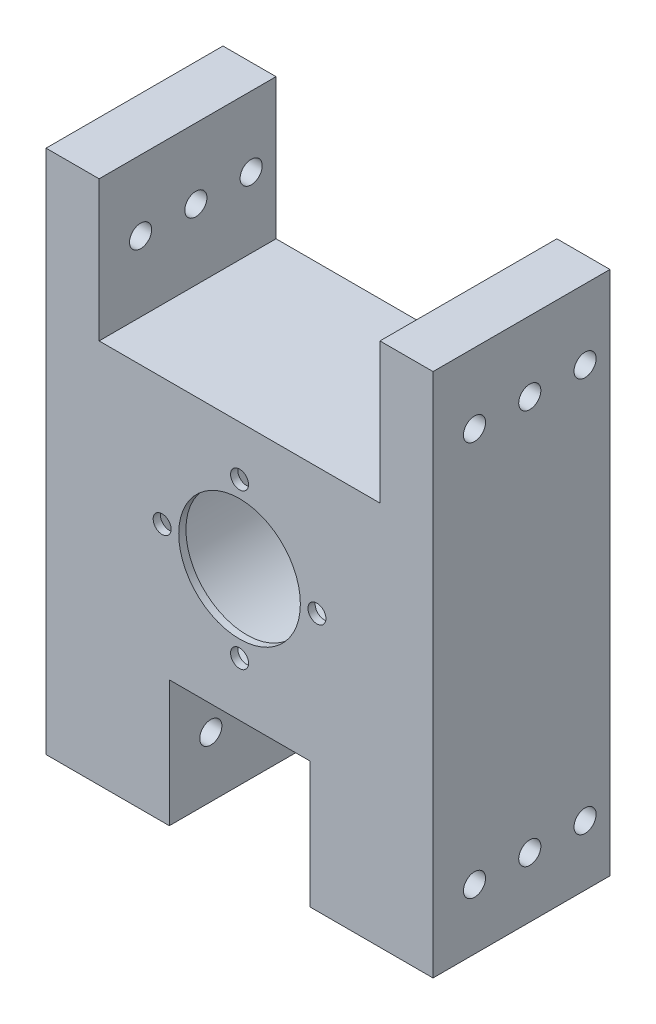
ISO-10303-21;
HEADER;
FILE_DESCRIPTION(('STEP AP214'),'2;1');
FILE_NAME('part.step','',(''),(''),'','','');
FILE_SCHEMA(('AUTOMOTIVE_DESIGN { 1 0 10303 214 1 1 1 1 }'));
ENDSEC;
DATA;
#1=APPLICATION_CONTEXT('core data for automotive mechanical design processes');
#2=APPLICATION_PROTOCOL_DEFINITION('international standard','automotive_design',2000,#1);
#3=PRODUCT_CONTEXT('',#1,'mechanical');
#4=PRODUCT('Part','Part','',(#3));
#5=PRODUCT_RELATED_PRODUCT_CATEGORY('part','',(#4));
#6=PRODUCT_DEFINITION_FORMATION('','',#4);
#7=PRODUCT_DEFINITION_CONTEXT('part definition',#1,'design');
#8=PRODUCT_DEFINITION('design','',#6,#7);
#9=PRODUCT_DEFINITION_SHAPE('','',#8);
#10=(LENGTH_UNIT() NAMED_UNIT(*) SI_UNIT(.MILLI.,.METRE.));
#11=(NAMED_UNIT(*) PLANE_ANGLE_UNIT() SI_UNIT($,.RADIAN.));
#12=(NAMED_UNIT(*) SI_UNIT($,.STERADIAN.) SOLID_ANGLE_UNIT());
#13=UNCERTAINTY_MEASURE_WITH_UNIT(LENGTH_MEASURE(1.E-05),#10,'distance_accuracy_value','');
#14=(GEOMETRIC_REPRESENTATION_CONTEXT(3) GLOBAL_UNCERTAINTY_ASSIGNED_CONTEXT((#13)) GLOBAL_UNIT_ASSIGNED_CONTEXT((#10,
#11,#12)) REPRESENTATION_CONTEXT('',''));
#15=CARTESIAN_POINT('',(0.,0.,0.));
#16=DIRECTION('',(0.,0.,1.));
#17=DIRECTION('',(1.,0.,0.));
#18=AXIS2_PLACEMENT_3D('',#15,#16,#17);
#19=CARTESIAN_POINT('',(35.,-20.,55.));
#20=DIRECTION('',(-1.,0.,0.));
#21=DIRECTION('',(0.,-1.,0.));
#22=AXIS2_PLACEMENT_3D('',#19,#20,#21);
#23=PLANE('',#22);
#24=CARTESIAN_POINT('',(35.,-35.7,37.5));
#25=DIRECTION('',(1.,0.,0.));
#26=DIRECTION('',(0.,0.,-1.));
#27=AXIS2_PLACEMENT_3D('',#24,#25,#26);
#28=CIRCLE('',#27,2.);
#29=CARTESIAN_POINT('',(35.,-35.7,35.5));
#30=VERTEX_POINT('',#29);
#31=EDGE_CURVE('E302',#30,#30,#28,.F.);
#32=ORIENTED_EDGE('',*,*,#31,.T.);
#33=EDGE_LOOP('',(#32));
#34=FACE_BOUND('',#33,.T.);
#35=CARTESIAN_POINT('',(35.,-35.7,47.5));
#36=DIRECTION('',(1.,0.,0.));
#37=DIRECTION('',(0.,0.,-1.));
#38=AXIS2_PLACEMENT_3D('',#35,#36,#37);
#39=CIRCLE('',#38,2.);
#40=CARTESIAN_POINT('',(35.,-35.7,45.5));
#41=VERTEX_POINT('',#40);
#42=EDGE_CURVE('E312',#41,#41,#39,.F.);
#43=ORIENTED_EDGE('',*,*,#42,.T.);
#44=EDGE_LOOP('',(#43));
#45=FACE_BOUND('',#44,.T.);
#46=CARTESIAN_POINT('',(35.,35.7,47.5));
#47=DIRECTION('',(1.,0.,0.));
#48=DIRECTION('',(0.,0.,-1.));
#49=AXIS2_PLACEMENT_3D('',#46,#47,#48);
#50=CIRCLE('',#49,2.);
#51=CARTESIAN_POINT('',(35.,35.7,45.5));
#52=VERTEX_POINT('',#51);
#53=EDGE_CURVE('E301',#52,#52,#50,.T.);
#54=ORIENTED_EDGE('',*,*,#53,.F.);
#55=EDGE_LOOP('',(#54));
#56=FACE_BOUND('',#55,.T.);
#57=CARTESIAN_POINT('',(35.,35.7,27.5));
#58=DIRECTION('',(1.,0.,0.));
#59=DIRECTION('',(0.,0.,-1.));
#60=AXIS2_PLACEMENT_3D('',#57,#58,#59);
#61=CIRCLE('',#60,2.00000000000001);
#62=CARTESIAN_POINT('',(35.,35.7,25.5));
#63=VERTEX_POINT('',#62);
#64=EDGE_CURVE('E328',#63,#63,#61,.T.);
#65=ORIENTED_EDGE('',*,*,#64,.F.);
#66=EDGE_LOOP('',(#65));
#67=FACE_BOUND('',#66,.T.);
#68=DIRECTION('',(0.,0.,-1.));
#69=VECTOR('',#68,1.);
#70=CARTESIAN_POINT('',(35.,-46.6,55.));
#71=LINE('',#70,#69);
#72=CARTESIAN_POINT('',(35.,-46.6,55.));
#73=VERTEX_POINT('',#72);
#74=CARTESIAN_POINT('',(35.,-46.6,23.));
#75=VERTEX_POINT('',#74);
#76=EDGE_CURVE('E152',#73,#75,#71,.T.);
#77=ORIENTED_EDGE('',*,*,#76,.T.);
#78=DIRECTION('',(0.,-1.,0.));
#79=VECTOR('',#78,1.);
#80=CARTESIAN_POINT('',(35.,-1.1,23.));
#81=LINE('',#80,#79);
#82=CARTESIAN_POINT('',(35.,48.4,23.));
#83=VERTEX_POINT('',#82);
#84=EDGE_CURVE('E134',#83,#75,#81,.T.);
#85=ORIENTED_EDGE('',*,*,#84,.F.);
#86=DIRECTION('',(0.,0.,-1.));
#87=VECTOR('',#86,1.);
#88=CARTESIAN_POINT('',(35.,48.4,55.));
#89=LINE('',#88,#87);
#90=CARTESIAN_POINT('',(35.,48.4,55.));
#91=VERTEX_POINT('',#90);
#92=EDGE_CURVE('E149',#91,#83,#89,.T.);
#93=ORIENTED_EDGE('',*,*,#92,.F.);
#94=DIRECTION('',(0.,1.,0.));
#95=VECTOR('',#94,1.);
#96=CARTESIAN_POINT('',(35.,-20.,55.));
#97=LINE('',#96,#95);
#98=EDGE_CURVE('E234',#73,#91,#97,.T.);
#99=ORIENTED_EDGE('',*,*,#98,.F.);
#100=EDGE_LOOP('',(#77,#85,#93,#99));
#101=FACE_BOUND('',#100,.T.);
#102=CARTESIAN_POINT('',(35.,-35.7,27.5));
#103=DIRECTION('',(1.,0.,0.));
#104=DIRECTION('',(0.,0.,-1.));
#105=AXIS2_PLACEMENT_3D('',#102,#103,#104);
#106=CIRCLE('',#105,2.);
#107=CARTESIAN_POINT('',(35.,-35.7,25.5));
#108=VERTEX_POINT('',#107);
#109=EDGE_CURVE('E311',#108,#108,#106,.F.);
#110=ORIENTED_EDGE('',*,*,#109,.T.);
#111=EDGE_LOOP('',(#110));
#112=FACE_BOUND('',#111,.T.);
#113=CARTESIAN_POINT('',(35.,35.7,37.5));
#114=DIRECTION('',(1.,0.,0.));
#115=DIRECTION('',(0.,0.,-1.));
#116=AXIS2_PLACEMENT_3D('',#113,#114,#115);
#117=CIRCLE('',#116,2.);
#118=CARTESIAN_POINT('',(35.,35.7,35.5));
#119=VERTEX_POINT('',#118);
#120=EDGE_CURVE('E327',#119,#119,#117,.T.);
#121=ORIENTED_EDGE('',*,*,#120,.F.);
#122=EDGE_LOOP('',(#121));
#123=FACE_BOUND('',#122,.T.);
#124=ADVANCED_FACE('F39',(#34,#45,#56,#67,#101,#112,#123),#23,.F.);
#125=CARTESIAN_POINT('',(-35.,-24.5,55.));
#126=DIRECTION('',(1.,0.,0.));
#127=DIRECTION('',(0.,0.,-1.));
#128=AXIS2_PLACEMENT_3D('',#125,#126,#127);
#129=PLANE('',#128);
#130=CARTESIAN_POINT('',(-35.,-35.7,37.5));
#131=DIRECTION('',(1.,0.,0.));
#132=DIRECTION('',(0.,0.,-1.));
#133=AXIS2_PLACEMENT_3D('',#130,#131,#132);
#134=CIRCLE('',#133,2.);
#135=CARTESIAN_POINT('',(-35.,-35.7,35.5));
#136=VERTEX_POINT('',#135);
#137=EDGE_CURVE('E306',#136,#136,#134,.F.);
#138=ORIENTED_EDGE('',*,*,#137,.F.);
#139=EDGE_LOOP('',(#138));
#140=FACE_BOUND('',#139,.T.);
#141=CARTESIAN_POINT('',(-35.,-35.7,47.5));
#142=DIRECTION('',(1.,0.,0.));
#143=DIRECTION('',(0.,0.,-1.));
#144=AXIS2_PLACEMENT_3D('',#141,#142,#143);
#145=CIRCLE('',#144,2.);
#146=CARTESIAN_POINT('',(-35.,-35.7,45.5));
#147=VERTEX_POINT('',#146);
#148=EDGE_CURVE('E307',#147,#147,#145,.F.);
#149=ORIENTED_EDGE('',*,*,#148,.F.);
#150=EDGE_LOOP('',(#149));
#151=FACE_BOUND('',#150,.T.);
#152=CARTESIAN_POINT('',(-35.,35.7,47.5));
#153=DIRECTION('',(1.,0.,0.));
#154=DIRECTION('',(0.,0.,-1.));
#155=AXIS2_PLACEMENT_3D('',#152,#153,#154);
#156=CIRCLE('',#155,2.);
#157=CARTESIAN_POINT('',(-35.,35.7,45.5));
#158=VERTEX_POINT('',#157);
#159=EDGE_CURVE('E323',#158,#158,#156,.T.);
#160=ORIENTED_EDGE('',*,*,#159,.T.);
#161=EDGE_LOOP('',(#160));
#162=FACE_BOUND('',#161,.T.);
#163=CARTESIAN_POINT('',(-35.,35.7,27.5));
#164=DIRECTION('',(1.,0.,0.));
#165=DIRECTION('',(0.,0.,-1.));
#166=AXIS2_PLACEMENT_3D('',#163,#164,#165);
#167=CIRCLE('',#166,2.00000000000001);
#168=CARTESIAN_POINT('',(-35.,35.7,25.5));
#169=VERTEX_POINT('',#168);
#170=EDGE_CURVE('E316',#169,#169,#167,.T.);
#171=ORIENTED_EDGE('',*,*,#170,.T.);
#172=EDGE_LOOP('',(#171));
#173=FACE_BOUND('',#172,.T.);
#174=DIRECTION('',(0.,0.,-1.));
#175=VECTOR('',#174,1.);
#176=CARTESIAN_POINT('',(-35.,48.4,55.));
#177=LINE('',#176,#175);
#178=CARTESIAN_POINT('',(-35.,48.4,55.));
#179=VERTEX_POINT('',#178);
#180=CARTESIAN_POINT('',(-35.,48.4,23.));
#181=VERTEX_POINT('',#180);
#182=EDGE_CURVE('E251',#179,#181,#177,.T.);
#183=ORIENTED_EDGE('',*,*,#182,.T.);
#184=DIRECTION('',(0.,-1.,0.));
#185=VECTOR('',#184,1.);
#186=CARTESIAN_POINT('',(-35.,-24.5,23.));
#187=LINE('',#186,#185);
#188=CARTESIAN_POINT('',(-35.,-46.6,23.));
#189=VERTEX_POINT('',#188);
#190=EDGE_CURVE('E57',#181,#189,#187,.T.);
#191=ORIENTED_EDGE('',*,*,#190,.T.);
#192=DIRECTION('',(0.,0.,-1.));
#193=VECTOR('',#192,1.);
#194=CARTESIAN_POINT('',(-35.,-46.6,55.));
#195=LINE('',#194,#193);
#196=CARTESIAN_POINT('',(-35.,-46.6,55.));
#197=VERTEX_POINT('',#196);
#198=EDGE_CURVE('E11',#197,#189,#195,.T.);
#199=ORIENTED_EDGE('',*,*,#198,.F.);
#200=DIRECTION('',(0.,-1.,0.));
#201=VECTOR('',#200,1.);
#202=CARTESIAN_POINT('',(-35.,-24.5,55.));
#203=LINE('',#202,#201);
#204=EDGE_CURVE('E65',#179,#197,#203,.T.);
#205=ORIENTED_EDGE('',*,*,#204,.F.);
#206=EDGE_LOOP('',(#183,#191,#199,#205));
#207=FACE_BOUND('',#206,.T.);
#208=CARTESIAN_POINT('',(-35.,-35.7,27.5));
#209=DIRECTION('',(1.,0.,0.));
#210=DIRECTION('',(0.,0.,-1.));
#211=AXIS2_PLACEMENT_3D('',#208,#209,#210);
#212=CIRCLE('',#211,2.);
#213=CARTESIAN_POINT('',(-35.,-35.7,25.5));
#214=VERTEX_POINT('',#213);
#215=EDGE_CURVE('E345',#214,#214,#212,.F.);
#216=ORIENTED_EDGE('',*,*,#215,.F.);
#217=EDGE_LOOP('',(#216));
#218=FACE_BOUND('',#217,.T.);
#219=CARTESIAN_POINT('',(-35.,35.7,37.5));
#220=DIRECTION('',(1.,0.,0.));
#221=DIRECTION('',(0.,0.,-1.));
#222=AXIS2_PLACEMENT_3D('',#219,#220,#221);
#223=CIRCLE('',#222,2.);
#224=CARTESIAN_POINT('',(-35.,35.7,35.5));
#225=VERTEX_POINT('',#224);
#226=EDGE_CURVE('E332',#225,#225,#223,.T.);
#227=ORIENTED_EDGE('',*,*,#226,.T.);
#228=EDGE_LOOP('',(#227));
#229=FACE_BOUND('',#228,.T.);
#230=ADVANCED_FACE('F425',(#140,#151,#162,#173,#207,#218,#229),#129,.F.);
#231=CARTESIAN_POINT('',(0.,0.,55.));
#232=DIRECTION('',(0.,0.,-1.));
#233=DIRECTION('',(-1.,0.,0.));
#234=AXIS2_PLACEMENT_3D('',#231,#232,#233);
#235=CYLINDRICAL_SURFACE('',#234,11.);
#236=CARTESIAN_POINT('',(0.,0.,55.));
#237=DIRECTION('',(0.,0.,1.));
#238=DIRECTION('',(1.,0.,0.));
#239=AXIS2_PLACEMENT_3D('',#236,#237,#238);
#240=CIRCLE('',#239,11.);
#241=CARTESIAN_POINT('',(11.,0.,55.));
#242=VERTEX_POINT('',#241);
#243=EDGE_CURVE('E186',#242,#242,#240,.T.);
#244=ORIENTED_EDGE('',*,*,#243,.T.);
#245=EDGE_LOOP('',(#244));
#246=FACE_BOUND('',#245,.T.);
#247=CARTESIAN_POINT('',(0.,0.,53.7));
#248=DIRECTION('',(0.,0.,-1.));
#249=DIRECTION('',(-1.,0.,0.));
#250=AXIS2_PLACEMENT_3D('',#247,#248,#249);
#251=CIRCLE('',#250,11.);
#252=CARTESIAN_POINT('',(-11.,0.,53.7));
#253=VERTEX_POINT('',#252);
#254=EDGE_CURVE('E182',#253,#253,#251,.T.);
#255=ORIENTED_EDGE('',*,*,#254,.T.);
#256=EDGE_LOOP('',(#255));
#257=FACE_BOUND('',#256,.T.);
#258=ADVANCED_FACE('F417',(#246,#257),#235,.F.);
#259=CARTESIAN_POINT('',(0.,0.,55.));
#260=DIRECTION('',(0.,0.,1.));
#261=DIRECTION('',(1.,0.,0.));
#262=AXIS2_PLACEMENT_3D('',#259,#260,#261);
#263=PLANE('',#262);
#264=CARTESIAN_POINT('',(0.,14.,55.));
#265=DIRECTION('',(0.,0.,1.));
#266=DIRECTION('',(1.,0.,0.));
#267=AXIS2_PLACEMENT_3D('',#264,#265,#266);
#268=CIRCLE('',#267,1.625);
#269=CARTESIAN_POINT('',(1.625,14.,55.));
#270=VERTEX_POINT('',#269);
#271=EDGE_CURVE('E193',#270,#270,#268,.T.);
#272=ORIENTED_EDGE('',*,*,#271,.F.);
#273=EDGE_LOOP('',(#272));
#274=FACE_BOUND('',#273,.T.);
#275=CARTESIAN_POINT('',(14.,0.,55.));
#276=DIRECTION('',(0.,0.,1.));
#277=DIRECTION('',(1.,0.,0.));
#278=AXIS2_PLACEMENT_3D('',#275,#276,#277);
#279=CIRCLE('',#278,1.625);
#280=CARTESIAN_POINT('',(15.625,0.,55.));
#281=VERTEX_POINT('',#280);
#282=EDGE_CURVE('E400',#281,#281,#279,.T.);
#283=ORIENTED_EDGE('',*,*,#282,.F.);
#284=EDGE_LOOP('',(#283));
#285=FACE_BOUND('',#284,.T.);
#286=CARTESIAN_POINT('',(0.,-14.,55.));
#287=DIRECTION('',(0.,0.,1.));
#288=DIRECTION('',(1.,0.,0.));
#289=AXIS2_PLACEMENT_3D('',#286,#287,#288);
#290=CIRCLE('',#289,1.625);
#291=CARTESIAN_POINT('',(1.625,-14.,55.));
#292=VERTEX_POINT('',#291);
#293=EDGE_CURVE('E403',#292,#292,#290,.T.);
#294=ORIENTED_EDGE('',*,*,#293,.F.);
#295=EDGE_LOOP('',(#294));
#296=FACE_BOUND('',#295,.T.);
#297=CARTESIAN_POINT('',(-14.,0.,55.));
#298=DIRECTION('',(0.,0.,1.));
#299=DIRECTION('',(1.,0.,0.));
#300=AXIS2_PLACEMENT_3D('',#297,#298,#299);
#301=CIRCLE('',#300,1.625);
#302=CARTESIAN_POINT('',(-12.375,0.,55.));
#303=VERTEX_POINT('',#302);
#304=EDGE_CURVE('E212',#303,#303,#301,.T.);
#305=ORIENTED_EDGE('',*,*,#304,.F.);
#306=EDGE_LOOP('',(#305));
#307=FACE_BOUND('',#306,.T.);
#308=ORIENTED_EDGE('',*,*,#204,.T.);
#309=DIRECTION('',(1.,0.,0.));
#310=VECTOR('',#309,1.);
#311=CARTESIAN_POINT('',(-35.,-46.6,55.));
#312=LINE('',#311,#310);
#313=CARTESIAN_POINT('',(-12.7,-46.6,55.));
#314=VERTEX_POINT('',#313);
#315=EDGE_CURVE('E219',#197,#314,#312,.T.);
#316=ORIENTED_EDGE('',*,*,#315,.T.);
#317=DIRECTION('',(0.,1.,0.));
#318=VECTOR('',#317,1.);
#319=CARTESIAN_POINT('',(-12.7,-23.74,55.));
#320=LINE('',#319,#318);
#321=CARTESIAN_POINT('',(-12.7,-23.74,55.));
#322=VERTEX_POINT('',#321);
#323=EDGE_CURVE('E222',#314,#322,#320,.T.);
#324=ORIENTED_EDGE('',*,*,#323,.T.);
#325=DIRECTION('',(1.,0.,0.));
#326=VECTOR('',#325,1.);
#327=CARTESIAN_POINT('',(-12.7,-23.74,55.));
#328=LINE('',#327,#326);
#329=CARTESIAN_POINT('',(12.7,-23.74,55.));
#330=VERTEX_POINT('',#329);
#331=EDGE_CURVE('E225',#322,#330,#328,.T.);
#332=ORIENTED_EDGE('',*,*,#331,.T.);
#333=DIRECTION('',(0.,-1.,0.));
#334=VECTOR('',#333,1.);
#335=CARTESIAN_POINT('',(12.7,-23.74,55.));
#336=LINE('',#335,#334);
#337=CARTESIAN_POINT('',(12.7,-46.6,55.));
#338=VERTEX_POINT('',#337);
#339=EDGE_CURVE('E228',#330,#338,#336,.T.);
#340=ORIENTED_EDGE('',*,*,#339,.T.);
#341=DIRECTION('',(1.,0.,0.));
#342=VECTOR('',#341,1.);
#343=CARTESIAN_POINT('',(35.,-46.6,55.));
#344=LINE('',#343,#342);
#345=EDGE_CURVE('E231',#338,#73,#344,.T.);
#346=ORIENTED_EDGE('',*,*,#345,.T.);
#347=ORIENTED_EDGE('',*,*,#98,.T.);
#348=DIRECTION('',(-1.,0.,0.));
#349=VECTOR('',#348,1.);
#350=CARTESIAN_POINT('',(25.4,48.4,55.));
#351=LINE('',#350,#349);
#352=CARTESIAN_POINT('',(25.4,48.4,55.));
#353=VERTEX_POINT('',#352);
#354=EDGE_CURVE('E156',#91,#353,#351,.T.);
#355=ORIENTED_EDGE('',*,*,#354,.T.);
#356=DIRECTION('',(0.,-1.,0.));
#357=VECTOR('',#356,1.);
#358=CARTESIAN_POINT('',(25.4,23.,55.));
#359=LINE('',#358,#357);
#360=CARTESIAN_POINT('',(25.4,23.,55.));
#361=VERTEX_POINT('',#360);
#362=EDGE_CURVE('E239',#353,#361,#359,.T.);
#363=ORIENTED_EDGE('',*,*,#362,.T.);
#364=DIRECTION('',(-1.,0.,0.));
#365=VECTOR('',#364,1.);
#366=CARTESIAN_POINT('',(-25.4,23.,55.));
#367=LINE('',#366,#365);
#368=CARTESIAN_POINT('',(-25.4,23.,55.));
#369=VERTEX_POINT('',#368);
#370=EDGE_CURVE('E242',#361,#369,#367,.T.);
#371=ORIENTED_EDGE('',*,*,#370,.T.);
#372=DIRECTION('',(0.,1.,0.));
#373=VECTOR('',#372,1.);
#374=CARTESIAN_POINT('',(-25.4,48.4,55.));
#375=LINE('',#374,#373);
#376=CARTESIAN_POINT('',(-25.4,48.4,55.));
#377=VERTEX_POINT('',#376);
#378=EDGE_CURVE('E245',#369,#377,#375,.T.);
#379=ORIENTED_EDGE('',*,*,#378,.T.);
#380=DIRECTION('',(-1.,0.,0.));
#381=VECTOR('',#380,1.);
#382=CARTESIAN_POINT('',(-25.4,48.4,55.));
#383=LINE('',#382,#381);
#384=EDGE_CURVE('E248',#377,#179,#383,.T.);
#385=ORIENTED_EDGE('',*,*,#384,.T.);
#386=EDGE_LOOP('',(#308,#316,#324,#332,#340,#346,#347,#355,#363,#371,#379,#385));
#387=FACE_BOUND('',#386,.T.);
#388=ORIENTED_EDGE('',*,*,#243,.F.);
#389=EDGE_LOOP('',(#388));
#390=FACE_BOUND('',#389,.T.);
#391=ADVANCED_FACE('F414',(#274,#285,#296,#307,#387,#390),#263,.T.);
#392=CARTESIAN_POINT('',(-35.,-46.6,55.));
#393=DIRECTION('',(0.,1.,0.));
#394=DIRECTION('',(-1.,0.,0.));
#395=AXIS2_PLACEMENT_3D('',#392,#393,#394);
#396=PLANE('',#395);
#397=ORIENTED_EDGE('',*,*,#198,.T.);
#398=DIRECTION('',(1.,0.,0.));
#399=VECTOR('',#398,1.);
#400=CARTESIAN_POINT('',(-35.,-46.6,23.));
#401=LINE('',#400,#399);
#402=CARTESIAN_POINT('',(-12.7,-46.6,23.));
#403=VERTEX_POINT('',#402);
#404=EDGE_CURVE('E282',#189,#403,#401,.T.);
#405=ORIENTED_EDGE('',*,*,#404,.T.);
#406=DIRECTION('',(0.,0.,-1.));
#407=VECTOR('',#406,1.);
#408=CARTESIAN_POINT('',(-12.7,-46.6,55.));
#409=LINE('',#408,#407);
#410=EDGE_CURVE('E49',#314,#403,#409,.T.);
#411=ORIENTED_EDGE('',*,*,#410,.F.);
#412=ORIENTED_EDGE('',*,*,#315,.F.);
#413=EDGE_LOOP('',(#397,#405,#411,#412));
#414=FACE_BOUND('',#413,.T.);
#415=ADVANCED_FACE('F41',(#414),#396,.F.);
#416=CARTESIAN_POINT('',(-12.7,-23.74,55.));
#417=DIRECTION('',(-1.,0.,0.));
#418=DIRECTION('',(0.,-1.,0.));
#419=AXIS2_PLACEMENT_3D('',#416,#417,#418);
#420=PLANE('',#419);
#421=CARTESIAN_POINT('',(-12.7,-35.7,37.5));
#422=DIRECTION('',(-1.,0.,0.));
#423=DIRECTION('',(0.,-1.,0.));
#424=AXIS2_PLACEMENT_3D('',#421,#422,#423);
#425=CIRCLE('',#424,2.);
#426=CARTESIAN_POINT('',(-12.7,-37.7,37.5));
#427=VERTEX_POINT('',#426);
#428=EDGE_CURVE('E393',#427,#427,#425,.F.);
#429=ORIENTED_EDGE('',*,*,#428,.F.);
#430=EDGE_LOOP('',(#429));
#431=FACE_BOUND('',#430,.T.);
#432=CARTESIAN_POINT('',(-12.7,-35.7,47.5));
#433=DIRECTION('',(-1.,0.,0.));
#434=DIRECTION('',(0.,-1.,0.));
#435=AXIS2_PLACEMENT_3D('',#432,#433,#434);
#436=CIRCLE('',#435,2.);
#437=CARTESIAN_POINT('',(-12.7,-37.7,47.5));
#438=VERTEX_POINT('',#437);
#439=EDGE_CURVE('E385',#438,#438,#436,.F.);
#440=ORIENTED_EDGE('',*,*,#439,.F.);
#441=EDGE_LOOP('',(#440));
#442=FACE_BOUND('',#441,.T.);
#443=CARTESIAN_POINT('',(-12.7,-35.7,27.5));
#444=DIRECTION('',(-1.,0.,0.));
#445=DIRECTION('',(0.,-1.,0.));
#446=AXIS2_PLACEMENT_3D('',#443,#444,#445);
#447=CIRCLE('',#446,2.);
#448=CARTESIAN_POINT('',(-12.7,-37.7,27.5));
#449=VERTEX_POINT('',#448);
#450=EDGE_CURVE('E353',#449,#449,#447,.F.);
#451=ORIENTED_EDGE('',*,*,#450,.F.);
#452=EDGE_LOOP('',(#451));
#453=FACE_BOUND('',#452,.T.);
#454=ORIENTED_EDGE('',*,*,#410,.T.);
#455=DIRECTION('',(0.,1.,0.));
#456=VECTOR('',#455,1.);
#457=CARTESIAN_POINT('',(-12.7,-23.74,23.));
#458=LINE('',#457,#456);
#459=CARTESIAN_POINT('',(-12.7,-23.74,23.));
#460=VERTEX_POINT('',#459);
#461=EDGE_CURVE('E286',#403,#460,#458,.T.);
#462=ORIENTED_EDGE('',*,*,#461,.T.);
#463=DIRECTION('',(0.,0.,-1.));
#464=VECTOR('',#463,1.);
#465=CARTESIAN_POINT('',(-12.7,-23.74,55.));
#466=LINE('',#465,#464);
#467=EDGE_CURVE('E175',#322,#460,#466,.T.);
#468=ORIENTED_EDGE('',*,*,#467,.F.);
#469=ORIENTED_EDGE('',*,*,#323,.F.);
#470=EDGE_LOOP('',(#454,#462,#468,#469));
#471=FACE_BOUND('',#470,.T.);
#472=ADVANCED_FACE('F467',(#431,#442,#453,#471),#420,.F.);
#473=CARTESIAN_POINT('',(-12.7,-23.74,55.));
#474=DIRECTION('',(0.,1.,0.));
#475=DIRECTION('',(0.,0.,1.));
#476=AXIS2_PLACEMENT_3D('',#473,#474,#475);
#477=PLANE('',#476);
#478=ORIENTED_EDGE('',*,*,#467,.T.);
#479=DIRECTION('',(1.,0.,0.));
#480=VECTOR('',#479,1.);
#481=CARTESIAN_POINT('',(-12.7,-23.74,23.));
#482=LINE('',#481,#480);
#483=CARTESIAN_POINT('',(12.7,-23.74,23.));
#484=VERTEX_POINT('',#483);
#485=EDGE_CURVE('E290',#460,#484,#482,.T.);
#486=ORIENTED_EDGE('',*,*,#485,.T.);
#487=DIRECTION('',(0.,0.,-1.));
#488=VECTOR('',#487,1.);
#489=CARTESIAN_POINT('',(12.7,-23.74,55.));
#490=LINE('',#489,#488);
#491=EDGE_CURVE('E171',#330,#484,#490,.T.);
#492=ORIENTED_EDGE('',*,*,#491,.F.);
#493=ORIENTED_EDGE('',*,*,#331,.F.);
#494=EDGE_LOOP('',(#478,#486,#492,#493));
#495=FACE_BOUND('',#494,.T.);
#496=ADVANCED_FACE('F464',(#495),#477,.F.);
#497=CARTESIAN_POINT('',(12.7,-23.74,55.));
#498=DIRECTION('',(1.,0.,0.));
#499=DIRECTION('',(0.,1.,0.));
#500=AXIS2_PLACEMENT_3D('',#497,#498,#499);
#501=PLANE('',#500);
#502=CARTESIAN_POINT('',(12.7,-35.7,37.5));
#503=DIRECTION('',(1.,0.,0.));
#504=DIRECTION('',(0.,1.,0.));
#505=AXIS2_PLACEMENT_3D('',#502,#503,#504);
#506=CIRCLE('',#505,2.);
#507=CARTESIAN_POINT('',(12.7,-33.7,37.5));
#508=VERTEX_POINT('',#507);
#509=EDGE_CURVE('E389',#508,#508,#506,.F.);
#510=ORIENTED_EDGE('',*,*,#509,.F.);
#511=EDGE_LOOP('',(#510));
#512=FACE_BOUND('',#511,.T.);
#513=CARTESIAN_POINT('',(12.7,-35.7,47.5));
#514=DIRECTION('',(1.,0.,0.));
#515=DIRECTION('',(0.,1.,0.));
#516=AXIS2_PLACEMENT_3D('',#513,#514,#515);
#517=CIRCLE('',#516,2.);
#518=CARTESIAN_POINT('',(12.7,-33.7,47.5));
#519=VERTEX_POINT('',#518);
#520=EDGE_CURVE('E381',#519,#519,#517,.F.);
#521=ORIENTED_EDGE('',*,*,#520,.F.);
#522=EDGE_LOOP('',(#521));
#523=FACE_BOUND('',#522,.T.);
#524=CARTESIAN_POINT('',(12.7,-35.7,27.5));
#525=DIRECTION('',(1.,0.,0.));
#526=DIRECTION('',(0.,1.,0.));
#527=AXIS2_PLACEMENT_3D('',#524,#525,#526);
#528=CIRCLE('',#527,2.);
#529=CARTESIAN_POINT('',(12.7,-33.7,27.5));
#530=VERTEX_POINT('',#529);
#531=EDGE_CURVE('E349',#530,#530,#528,.F.);
#532=ORIENTED_EDGE('',*,*,#531,.F.);
#533=EDGE_LOOP('',(#532));
#534=FACE_BOUND('',#533,.T.);
#535=ORIENTED_EDGE('',*,*,#491,.T.);
#536=DIRECTION('',(0.,-1.,0.));
#537=VECTOR('',#536,1.);
#538=CARTESIAN_POINT('',(12.7,-23.74,23.));
#539=LINE('',#538,#537);
#540=CARTESIAN_POINT('',(12.7,-46.6,23.));
#541=VERTEX_POINT('',#540);
#542=EDGE_CURVE('E294',#484,#541,#539,.T.);
#543=ORIENTED_EDGE('',*,*,#542,.T.);
#544=DIRECTION('',(0.,0.,-1.));
#545=VECTOR('',#544,1.);
#546=CARTESIAN_POINT('',(12.7,-46.6,55.));
#547=LINE('',#546,#545);
#548=EDGE_CURVE('E162',#338,#541,#547,.T.);
#549=ORIENTED_EDGE('',*,*,#548,.F.);
#550=ORIENTED_EDGE('',*,*,#339,.F.);
#551=EDGE_LOOP('',(#535,#543,#549,#550));
#552=FACE_BOUND('',#551,.T.);
#553=ADVANCED_FACE('F460',(#512,#523,#534,#552),#501,.F.);
#554=CARTESIAN_POINT('',(35.,-46.6,55.));
#555=DIRECTION('',(0.,1.,0.));
#556=DIRECTION('',(-1.,0.,0.));
#557=AXIS2_PLACEMENT_3D('',#554,#555,#556);
#558=PLANE('',#557);
#559=ORIENTED_EDGE('',*,*,#548,.T.);
#560=DIRECTION('',(1.,0.,0.));
#561=VECTOR('',#560,1.);
#562=CARTESIAN_POINT('',(35.,-46.6,23.));
#563=LINE('',#562,#561);
#564=EDGE_CURVE('E298',#541,#75,#563,.T.);
#565=ORIENTED_EDGE('',*,*,#564,.T.);
#566=ORIENTED_EDGE('',*,*,#76,.F.);
#567=ORIENTED_EDGE('',*,*,#345,.F.);
#568=EDGE_LOOP('',(#559,#565,#566,#567));
#569=FACE_BOUND('',#568,.T.);
#570=ADVANCED_FACE('F457',(#569),#558,.F.);
#571=CARTESIAN_POINT('',(25.4,48.4,55.));
#572=DIRECTION('',(0.,-1.,0.));
#573=DIRECTION('',(1.,0.,0.));
#574=AXIS2_PLACEMENT_3D('',#571,#572,#573);
#575=PLANE('',#574);
#576=ORIENTED_EDGE('',*,*,#92,.T.);
#577=DIRECTION('',(-1.,0.,0.));
#578=VECTOR('',#577,1.);
#579=CARTESIAN_POINT('',(25.4,48.4,23.));
#580=LINE('',#579,#578);
#581=CARTESIAN_POINT('',(25.4,48.4,23.));
#582=VERTEX_POINT('',#581);
#583=EDGE_CURVE('E131',#83,#582,#580,.T.);
#584=ORIENTED_EDGE('',*,*,#583,.T.);
#585=DIRECTION('',(0.,0.,-1.));
#586=VECTOR('',#585,1.);
#587=CARTESIAN_POINT('',(25.4,48.4,55.));
#588=LINE('',#587,#586);
#589=EDGE_CURVE('E158',#353,#582,#588,.T.);
#590=ORIENTED_EDGE('',*,*,#589,.F.);
#591=ORIENTED_EDGE('',*,*,#354,.F.);
#592=EDGE_LOOP('',(#576,#584,#590,#591));
#593=FACE_BOUND('',#592,.T.);
#594=ADVANCED_FACE('F155',(#593),#575,.F.);
#595=CARTESIAN_POINT('',(25.4,23.,55.));
#596=DIRECTION('',(1.,0.,0.));
#597=DIRECTION('',(0.,1.,0.));
#598=AXIS2_PLACEMENT_3D('',#595,#596,#597);
#599=PLANE('',#598);
#600=CARTESIAN_POINT('',(25.4,35.7,47.5));
#601=DIRECTION('',(1.,0.,0.));
#602=DIRECTION('',(0.,1.,0.));
#603=AXIS2_PLACEMENT_3D('',#600,#601,#602);
#604=CIRCLE('',#603,2.);
#605=CARTESIAN_POINT('',(25.4,37.7,47.5));
#606=VERTEX_POINT('',#605);
#607=EDGE_CURVE('E377',#606,#606,#604,.T.);
#608=ORIENTED_EDGE('',*,*,#607,.T.);
#609=EDGE_LOOP('',(#608));
#610=FACE_BOUND('',#609,.T.);
#611=CARTESIAN_POINT('',(25.4,35.7,37.5));
#612=DIRECTION('',(1.,0.,0.));
#613=DIRECTION('',(0.,1.,0.));
#614=AXIS2_PLACEMENT_3D('',#611,#612,#613);
#615=CIRCLE('',#614,2.);
#616=CARTESIAN_POINT('',(25.4,37.7,37.5));
#617=VERTEX_POINT('',#616);
#618=EDGE_CURVE('E369',#617,#617,#615,.T.);
#619=ORIENTED_EDGE('',*,*,#618,.T.);
#620=EDGE_LOOP('',(#619));
#621=FACE_BOUND('',#620,.T.);
#622=CARTESIAN_POINT('',(25.4,35.7,27.5));
#623=DIRECTION('',(1.,0.,0.));
#624=DIRECTION('',(0.,1.,0.));
#625=AXIS2_PLACEMENT_3D('',#622,#623,#624);
#626=CIRCLE('',#625,2.00000000000001);
#627=CARTESIAN_POINT('',(25.4,37.7,27.5));
#628=VERTEX_POINT('',#627);
#629=EDGE_CURVE('E361',#628,#628,#626,.T.);
#630=ORIENTED_EDGE('',*,*,#629,.T.);
#631=EDGE_LOOP('',(#630));
#632=FACE_BOUND('',#631,.T.);
#633=ORIENTED_EDGE('',*,*,#589,.T.);
#634=DIRECTION('',(0.,-1.,0.));
#635=VECTOR('',#634,1.);
#636=CARTESIAN_POINT('',(25.4,23.,23.));
#637=LINE('',#636,#635);
#638=CARTESIAN_POINT('',(25.4,23.,23.));
#639=VERTEX_POINT('',#638);
#640=EDGE_CURVE('E137',#582,#639,#637,.T.);
#641=ORIENTED_EDGE('',*,*,#640,.T.);
#642=DIRECTION('',(0.,0.,-1.));
#643=VECTOR('',#642,1.);
#644=CARTESIAN_POINT('',(25.4,23.,55.));
#645=LINE('',#644,#643);
#646=EDGE_CURVE('E164',#361,#639,#645,.T.);
#647=ORIENTED_EDGE('',*,*,#646,.F.);
#648=ORIENTED_EDGE('',*,*,#362,.F.);
#649=EDGE_LOOP('',(#633,#641,#647,#648));
#650=FACE_BOUND('',#649,.T.);
#651=ADVANCED_FACE('F272',(#610,#621,#632,#650),#599,.F.);
#652=CARTESIAN_POINT('',(-25.4,23.,55.));
#653=DIRECTION('',(0.,-1.,0.));
#654=DIRECTION('',(1.,0.,0.));
#655=AXIS2_PLACEMENT_3D('',#652,#653,#654);
#656=PLANE('',#655);
#657=ORIENTED_EDGE('',*,*,#646,.T.);
#658=DIRECTION('',(-1.,0.,0.));
#659=VECTOR('',#658,1.);
#660=CARTESIAN_POINT('',(-25.4,23.,23.));
#661=LINE('',#660,#659);
#662=CARTESIAN_POINT('',(-25.4,23.,23.));
#663=VERTEX_POINT('',#662);
#664=EDGE_CURVE('E269',#639,#663,#661,.T.);
#665=ORIENTED_EDGE('',*,*,#664,.T.);
#666=DIRECTION('',(0.,0.,-1.));
#667=VECTOR('',#666,1.);
#668=CARTESIAN_POINT('',(-25.4,23.,55.));
#669=LINE('',#668,#667);
#670=EDGE_CURVE('E258',#369,#663,#669,.T.);
#671=ORIENTED_EDGE('',*,*,#670,.F.);
#672=ORIENTED_EDGE('',*,*,#370,.F.);
#673=EDGE_LOOP('',(#657,#665,#671,#672));
#674=FACE_BOUND('',#673,.T.);
#675=ADVANCED_FACE('F267',(#674),#656,.F.);
#676=CARTESIAN_POINT('',(-25.4,48.4,55.));
#677=DIRECTION('',(-1.,0.,0.));
#678=DIRECTION('',(0.,-1.,0.));
#679=AXIS2_PLACEMENT_3D('',#676,#677,#678);
#680=PLANE('',#679);
#681=CARTESIAN_POINT('',(-25.4,35.7,47.5));
#682=DIRECTION('',(-1.,0.,0.));
#683=DIRECTION('',(0.,-1.,0.));
#684=AXIS2_PLACEMENT_3D('',#681,#682,#683);
#685=CIRCLE('',#684,2.);
#686=CARTESIAN_POINT('',(-25.4,33.7,47.5));
#687=VERTEX_POINT('',#686);
#688=EDGE_CURVE('E373',#687,#687,#685,.T.);
#689=ORIENTED_EDGE('',*,*,#688,.T.);
#690=EDGE_LOOP('',(#689));
#691=FACE_BOUND('',#690,.T.);
#692=CARTESIAN_POINT('',(-25.4,35.7,37.5));
#693=DIRECTION('',(-1.,0.,0.));
#694=DIRECTION('',(0.,-1.,0.));
#695=AXIS2_PLACEMENT_3D('',#692,#693,#694);
#696=CIRCLE('',#695,2.);
#697=CARTESIAN_POINT('',(-25.4,33.7,37.5));
#698=VERTEX_POINT('',#697);
#699=EDGE_CURVE('E365',#698,#698,#696,.T.);
#700=ORIENTED_EDGE('',*,*,#699,.T.);
#701=EDGE_LOOP('',(#700));
#702=FACE_BOUND('',#701,.T.);
#703=CARTESIAN_POINT('',(-25.4,35.7,27.5));
#704=DIRECTION('',(-1.,0.,0.));
#705=DIRECTION('',(0.,-1.,0.));
#706=AXIS2_PLACEMENT_3D('',#703,#704,#705);
#707=CIRCLE('',#706,2.00000000000001);
#708=CARTESIAN_POINT('',(-25.4,33.7,27.5));
#709=VERTEX_POINT('',#708);
#710=EDGE_CURVE('E357',#709,#709,#707,.T.);
#711=ORIENTED_EDGE('',*,*,#710,.T.);
#712=EDGE_LOOP('',(#711));
#713=FACE_BOUND('',#712,.T.);
#714=ORIENTED_EDGE('',*,*,#670,.T.);
#715=DIRECTION('',(0.,1.,0.));
#716=VECTOR('',#715,1.);
#717=CARTESIAN_POINT('',(-25.4,48.4,23.));
#718=LINE('',#717,#716);
#719=CARTESIAN_POINT('',(-25.4,48.4,23.));
#720=VERTEX_POINT('',#719);
#721=EDGE_CURVE('E276',#663,#720,#718,.T.);
#722=ORIENTED_EDGE('',*,*,#721,.T.);
#723=DIRECTION('',(0.,0.,-1.));
#724=VECTOR('',#723,1.);
#725=CARTESIAN_POINT('',(-25.4,48.4,55.));
#726=LINE('',#725,#724);
#727=EDGE_CURVE('E254',#377,#720,#726,.T.);
#728=ORIENTED_EDGE('',*,*,#727,.F.);
#729=ORIENTED_EDGE('',*,*,#378,.F.);
#730=EDGE_LOOP('',(#714,#722,#728,#729));
#731=FACE_BOUND('',#730,.T.);
#732=ADVANCED_FACE('F687',(#691,#702,#713,#731),#680,.F.);
#733=CARTESIAN_POINT('',(-25.4,48.4,55.));
#734=DIRECTION('',(0.,-1.,0.));
#735=DIRECTION('',(0.,0.,-1.));
#736=AXIS2_PLACEMENT_3D('',#733,#734,#735);
#737=PLANE('',#736);
#738=ORIENTED_EDGE('',*,*,#727,.T.);
#739=DIRECTION('',(-1.,0.,0.));
#740=VECTOR('',#739,1.);
#741=CARTESIAN_POINT('',(-25.4,48.4,23.));
#742=LINE('',#741,#740);
#743=EDGE_CURVE('E488',#720,#181,#742,.T.);
#744=ORIENTED_EDGE('',*,*,#743,.T.);
#745=ORIENTED_EDGE('',*,*,#182,.F.);
#746=ORIENTED_EDGE('',*,*,#384,.F.);
#747=EDGE_LOOP('',(#738,#744,#745,#746));
#748=FACE_BOUND('',#747,.T.);
#749=ADVANCED_FACE('F441',(#748),#737,.F.);
#750=CARTESIAN_POINT('',(0.,0.,53.7));
#751=DIRECTION('',(0.,0.,-1.));
#752=DIRECTION('',(-1.,0.,0.));
#753=AXIS2_PLACEMENT_3D('',#750,#751,#752);
#754=CYLINDRICAL_SURFACE('',#753,18.);
#755=CARTESIAN_POINT('',(0.,0.,23.));
#756=DIRECTION('',(0.,0.,1.));
#757=DIRECTION('',(1.,0.,0.));
#758=AXIS2_PLACEMENT_3D('',#755,#756,#757);
#759=CIRCLE('',#758,18.);
#760=CARTESIAN_POINT('',(18.,0.,23.));
#761=VERTEX_POINT('',#760);
#762=EDGE_CURVE('E43',#761,#761,#759,.F.);
#763=ORIENTED_EDGE('',*,*,#762,.T.);
#764=EDGE_LOOP('',(#763));
#765=FACE_BOUND('',#764,.T.);
#766=CARTESIAN_POINT('',(0.,0.,53.7));
#767=DIRECTION('',(0.,0.,-1.));
#768=DIRECTION('',(-1.,0.,0.));
#769=AXIS2_PLACEMENT_3D('',#766,#767,#768);
#770=CIRCLE('',#769,18.);
#771=CARTESIAN_POINT('',(-18.,0.,53.7));
#772=VERTEX_POINT('',#771);
#773=EDGE_CURVE('E187',#772,#772,#770,.T.);
#774=ORIENTED_EDGE('',*,*,#773,.F.);
#775=EDGE_LOOP('',(#774));
#776=FACE_BOUND('',#775,.T.);
#777=ADVANCED_FACE('F431',(#765,#776),#754,.F.);
#778=CARTESIAN_POINT('',(0.,0.,53.7));
#779=DIRECTION('',(0.,0.,-1.));
#780=DIRECTION('',(-1.,0.,0.));
#781=AXIS2_PLACEMENT_3D('',#778,#779,#780);
#782=PLANE('',#781);
#783=CARTESIAN_POINT('',(0.,14.,53.7));
#784=DIRECTION('',(0.,0.,-1.));
#785=DIRECTION('',(-1.,0.,0.));
#786=AXIS2_PLACEMENT_3D('',#783,#784,#785);
#787=CIRCLE('',#786,1.625);
#788=CARTESIAN_POINT('',(-1.625,14.,53.7));
#789=VERTEX_POINT('',#788);
#790=EDGE_CURVE('E200',#789,#789,#787,.T.);
#791=ORIENTED_EDGE('',*,*,#790,.F.);
#792=EDGE_LOOP('',(#791));
#793=FACE_BOUND('',#792,.T.);
#794=CARTESIAN_POINT('',(14.,0.,53.7));
#795=DIRECTION('',(0.,0.,-1.));
#796=DIRECTION('',(-1.,0.,0.));
#797=AXIS2_PLACEMENT_3D('',#794,#795,#796);
#798=CIRCLE('',#797,1.625);
#799=CARTESIAN_POINT('',(12.375,0.,53.7));
#800=VERTEX_POINT('',#799);
#801=EDGE_CURVE('E197',#800,#800,#798,.T.);
#802=ORIENTED_EDGE('',*,*,#801,.F.);
#803=EDGE_LOOP('',(#802));
#804=FACE_BOUND('',#803,.T.);
#805=CARTESIAN_POINT('',(0.,-14.,53.7));
#806=DIRECTION('',(0.,0.,-1.));
#807=DIRECTION('',(-1.,0.,0.));
#808=AXIS2_PLACEMENT_3D('',#805,#806,#807);
#809=CIRCLE('',#808,1.625);
#810=CARTESIAN_POINT('',(-1.625,-14.,53.7));
#811=VERTEX_POINT('',#810);
#812=EDGE_CURVE('E192',#811,#811,#809,.T.);
#813=ORIENTED_EDGE('',*,*,#812,.F.);
#814=EDGE_LOOP('',(#813));
#815=FACE_BOUND('',#814,.T.);
#816=CARTESIAN_POINT('',(-14.,0.,53.7));
#817=DIRECTION('',(0.,0.,-1.));
#818=DIRECTION('',(-1.,0.,0.));
#819=AXIS2_PLACEMENT_3D('',#816,#817,#818);
#820=CIRCLE('',#819,1.625);
#821=CARTESIAN_POINT('',(-15.625,0.,53.7));
#822=VERTEX_POINT('',#821);
#823=EDGE_CURVE('E188',#822,#822,#820,.T.);
#824=ORIENTED_EDGE('',*,*,#823,.F.);
#825=EDGE_LOOP('',(#824));
#826=FACE_BOUND('',#825,.T.);
#827=ORIENTED_EDGE('',*,*,#254,.F.);
#828=EDGE_LOOP('',(#827));
#829=FACE_BOUND('',#828,.T.);
#830=ORIENTED_EDGE('',*,*,#773,.T.);
#831=EDGE_LOOP('',(#830));
#832=FACE_BOUND('',#831,.T.);
#833=ADVANCED_FACE('F429',(#793,#804,#815,#826,#829,#832),#782,.T.);
#834=CARTESIAN_POINT('',(-14.,0.,0.));
#835=DIRECTION('',(0.,0.,1.));
#836=DIRECTION('',(1.,0.,0.));
#837=AXIS2_PLACEMENT_3D('',#834,#835,#836);
#838=CYLINDRICAL_SURFACE('',#837,1.625);
#839=ORIENTED_EDGE('',*,*,#823,.T.);
#840=EDGE_LOOP('',(#839));
#841=FACE_BOUND('',#840,.T.);
#842=ORIENTED_EDGE('',*,*,#304,.T.);
#843=EDGE_LOOP('',(#842));
#844=FACE_BOUND('',#843,.T.);
#845=ADVANCED_FACE('F412',(#841,#844),#838,.F.);
#846=CARTESIAN_POINT('',(0.,-14.,0.));
#847=DIRECTION('',(0.,0.,1.));
#848=DIRECTION('',(1.,0.,0.));
#849=AXIS2_PLACEMENT_3D('',#846,#847,#848);
#850=CYLINDRICAL_SURFACE('',#849,1.625);
#851=ORIENTED_EDGE('',*,*,#812,.T.);
#852=EDGE_LOOP('',(#851));
#853=FACE_BOUND('',#852,.T.);
#854=ORIENTED_EDGE('',*,*,#293,.T.);
#855=EDGE_LOOP('',(#854));
#856=FACE_BOUND('',#855,.T.);
#857=ADVANCED_FACE('F438',(#853,#856),#850,.F.);
#858=CARTESIAN_POINT('',(14.,0.,0.));
#859=DIRECTION('',(0.,0.,1.));
#860=DIRECTION('',(1.,0.,0.));
#861=AXIS2_PLACEMENT_3D('',#858,#859,#860);
#862=CYLINDRICAL_SURFACE('',#861,1.625);
#863=ORIENTED_EDGE('',*,*,#801,.T.);
#864=EDGE_LOOP('',(#863));
#865=FACE_BOUND('',#864,.T.);
#866=ORIENTED_EDGE('',*,*,#282,.T.);
#867=EDGE_LOOP('',(#866));
#868=FACE_BOUND('',#867,.T.);
#869=ADVANCED_FACE('F539',(#865,#868),#862,.F.);
#870=CARTESIAN_POINT('',(0.,14.,0.));
#871=DIRECTION('',(0.,0.,1.));
#872=DIRECTION('',(1.,0.,0.));
#873=AXIS2_PLACEMENT_3D('',#870,#871,#872);
#874=CYLINDRICAL_SURFACE('',#873,1.625);
#875=ORIENTED_EDGE('',*,*,#790,.T.);
#876=EDGE_LOOP('',(#875));
#877=FACE_BOUND('',#876,.T.);
#878=ORIENTED_EDGE('',*,*,#271,.T.);
#879=EDGE_LOOP('',(#878));
#880=FACE_BOUND('',#879,.T.);
#881=ADVANCED_FACE('F535',(#877,#880),#874,.F.);
#882=CARTESIAN_POINT('',(-35.,-35.7,27.5));
#883=DIRECTION('',(1.,0.,0.));
#884=DIRECTION('',(0.,0.,-1.));
#885=AXIS2_PLACEMENT_3D('',#882,#883,#884);
#886=CYLINDRICAL_SURFACE('',#885,2.);
#887=ORIENTED_EDGE('',*,*,#215,.T.);
#888=EDGE_LOOP('',(#887));
#889=FACE_BOUND('',#888,.T.);
#890=ORIENTED_EDGE('',*,*,#450,.T.);
#891=EDGE_LOOP('',(#890));
#892=FACE_BOUND('',#891,.T.);
#893=ADVANCED_FACE('F532',(#889,#892),#886,.F.);
#894=CARTESIAN_POINT('',(-35.,35.7,27.5));
#895=DIRECTION('',(1.,0.,0.));
#896=DIRECTION('',(0.,0.,-1.));
#897=AXIS2_PLACEMENT_3D('',#894,#895,#896);
#898=CYLINDRICAL_SURFACE('',#897,2.00000000000001);
#899=ORIENTED_EDGE('',*,*,#170,.F.);
#900=EDGE_LOOP('',(#899));
#901=FACE_BOUND('',#900,.T.);
#902=ORIENTED_EDGE('',*,*,#710,.F.);
#903=EDGE_LOOP('',(#902));
#904=FACE_BOUND('',#903,.T.);
#905=ADVANCED_FACE('F527',(#901,#904),#898,.F.);
#906=CARTESIAN_POINT('',(-35.,35.7,37.5));
#907=DIRECTION('',(1.,0.,0.));
#908=DIRECTION('',(0.,0.,-1.));
#909=AXIS2_PLACEMENT_3D('',#906,#907,#908);
#910=CYLINDRICAL_SURFACE('',#909,2.);
#911=ORIENTED_EDGE('',*,*,#226,.F.);
#912=EDGE_LOOP('',(#911));
#913=FACE_BOUND('',#912,.T.);
#914=ORIENTED_EDGE('',*,*,#699,.F.);
#915=EDGE_LOOP('',(#914));
#916=FACE_BOUND('',#915,.T.);
#917=ADVANCED_FACE('F531',(#913,#916),#910,.F.);
#918=CARTESIAN_POINT('',(-35.,35.7,47.5));
#919=DIRECTION('',(1.,0.,0.));
#920=DIRECTION('',(0.,0.,-1.));
#921=AXIS2_PLACEMENT_3D('',#918,#919,#920);
#922=CYLINDRICAL_SURFACE('',#921,2.);
#923=ORIENTED_EDGE('',*,*,#159,.F.);
#924=EDGE_LOOP('',(#923));
#925=FACE_BOUND('',#924,.T.);
#926=ORIENTED_EDGE('',*,*,#688,.F.);
#927=EDGE_LOOP('',(#926));
#928=FACE_BOUND('',#927,.T.);
#929=ADVANCED_FACE('F516',(#925,#928),#922,.F.);
#930=CARTESIAN_POINT('',(-35.,-35.7,47.5));
#931=DIRECTION('',(1.,0.,0.));
#932=DIRECTION('',(0.,0.,-1.));
#933=AXIS2_PLACEMENT_3D('',#930,#931,#932);
#934=CYLINDRICAL_SURFACE('',#933,2.);
#935=ORIENTED_EDGE('',*,*,#148,.T.);
#936=EDGE_LOOP('',(#935));
#937=FACE_BOUND('',#936,.T.);
#938=ORIENTED_EDGE('',*,*,#439,.T.);
#939=EDGE_LOOP('',(#938));
#940=FACE_BOUND('',#939,.T.);
#941=ADVANCED_FACE('F512',(#937,#940),#934,.F.);
#942=CARTESIAN_POINT('',(-35.,-35.7,37.5));
#943=DIRECTION('',(1.,0.,0.));
#944=DIRECTION('',(0.,0.,-1.));
#945=AXIS2_PLACEMENT_3D('',#942,#943,#944);
#946=CYLINDRICAL_SURFACE('',#945,2.);
#947=ORIENTED_EDGE('',*,*,#137,.T.);
#948=EDGE_LOOP('',(#947));
#949=FACE_BOUND('',#948,.T.);
#950=ORIENTED_EDGE('',*,*,#428,.T.);
#951=EDGE_LOOP('',(#950));
#952=FACE_BOUND('',#951,.T.);
#953=ADVANCED_FACE('F508',(#949,#952),#946,.F.);
#954=ORIENTED_EDGE('',*,*,#64,.T.);
#955=EDGE_LOOP('',(#954));
#956=FACE_BOUND('',#955,.T.);
#957=ORIENTED_EDGE('',*,*,#629,.F.);
#958=EDGE_LOOP('',(#957));
#959=FACE_BOUND('',#958,.T.);
#960=ADVANCED_FACE('F511',(#956,#959),#898,.F.);
#961=ORIENTED_EDGE('',*,*,#120,.T.);
#962=EDGE_LOOP('',(#961));
#963=FACE_BOUND('',#962,.T.);
#964=ORIENTED_EDGE('',*,*,#618,.F.);
#965=EDGE_LOOP('',(#964));
#966=FACE_BOUND('',#965,.T.);
#967=ADVANCED_FACE('F522',(#963,#966),#910,.F.);
#968=ORIENTED_EDGE('',*,*,#53,.T.);
#969=EDGE_LOOP('',(#968));
#970=FACE_BOUND('',#969,.T.);
#971=ORIENTED_EDGE('',*,*,#607,.F.);
#972=EDGE_LOOP('',(#971));
#973=FACE_BOUND('',#972,.T.);
#974=ADVANCED_FACE('F518',(#970,#973),#922,.F.);
#975=ORIENTED_EDGE('',*,*,#109,.F.);
#976=EDGE_LOOP('',(#975));
#977=FACE_BOUND('',#976,.T.);
#978=ORIENTED_EDGE('',*,*,#531,.T.);
#979=EDGE_LOOP('',(#978));
#980=FACE_BOUND('',#979,.T.);
#981=ADVANCED_FACE('F521',(#977,#980),#886,.F.);
#982=ORIENTED_EDGE('',*,*,#42,.F.);
#983=EDGE_LOOP('',(#982));
#984=FACE_BOUND('',#983,.T.);
#985=ORIENTED_EDGE('',*,*,#520,.T.);
#986=EDGE_LOOP('',(#985));
#987=FACE_BOUND('',#986,.T.);
#988=ADVANCED_FACE('F505',(#984,#987),#934,.F.);
#989=ORIENTED_EDGE('',*,*,#31,.F.);
#990=EDGE_LOOP('',(#989));
#991=FACE_BOUND('',#990,.T.);
#992=ORIENTED_EDGE('',*,*,#509,.T.);
#993=EDGE_LOOP('',(#992));
#994=FACE_BOUND('',#993,.T.);
#995=ADVANCED_FACE('F500',(#991,#994),#946,.F.);
#996=CARTESIAN_POINT('',(-39.,-1.09999999999999,23.));
#997=DIRECTION('',(0.,0.,1.));
#998=DIRECTION('',(1.,0.,0.));
#999=AXIS2_PLACEMENT_3D('',#996,#997,#998);
#1000=PLANE('',#999);
#1001=ORIENTED_EDGE('',*,*,#762,.F.);
#1002=EDGE_LOOP('',(#1001));
#1003=FACE_BOUND('',#1002,.T.);
#1004=ORIENTED_EDGE('',*,*,#542,.F.);
#1005=ORIENTED_EDGE('',*,*,#485,.F.);
#1006=ORIENTED_EDGE('',*,*,#461,.F.);
#1007=ORIENTED_EDGE('',*,*,#404,.F.);
#1008=ORIENTED_EDGE('',*,*,#190,.F.);
#1009=ORIENTED_EDGE('',*,*,#743,.F.);
#1010=ORIENTED_EDGE('',*,*,#721,.F.);
#1011=ORIENTED_EDGE('',*,*,#664,.F.);
#1012=ORIENTED_EDGE('',*,*,#640,.F.);
#1013=ORIENTED_EDGE('',*,*,#583,.F.);
#1014=ORIENTED_EDGE('',*,*,#84,.T.);
#1015=ORIENTED_EDGE('',*,*,#564,.F.);
#1016=EDGE_LOOP('',(#1004,#1005,#1006,#1007,#1008,#1009,#1010,#1011,#1012,#1013,#1014,#1015));
#1017=FACE_BOUND('',#1016,.T.);
#1018=ADVANCED_FACE('F133',(#1003,#1017),#1000,.F.);
#1019=CLOSED_SHELL('',(#124,#230,#258,#391,#415,#472,#496,#553,#570,#594,#651,#675,#732,#749,
#777,#833,#845,#857,#869,#881,#893,#905,#917,#929,#941,#953,#960,#967,#974,#981,#988,#995,#1018));
#1020=MANIFOLD_SOLID_BREP('B2',#1019);
#1021=ADVANCED_BREP_SHAPE_REPRESENTATION('',(#18,#1020),#14);
#1022=SHAPE_DEFINITION_REPRESENTATION(#9,#1021);
ENDSEC;
END-ISO-10303-21;
